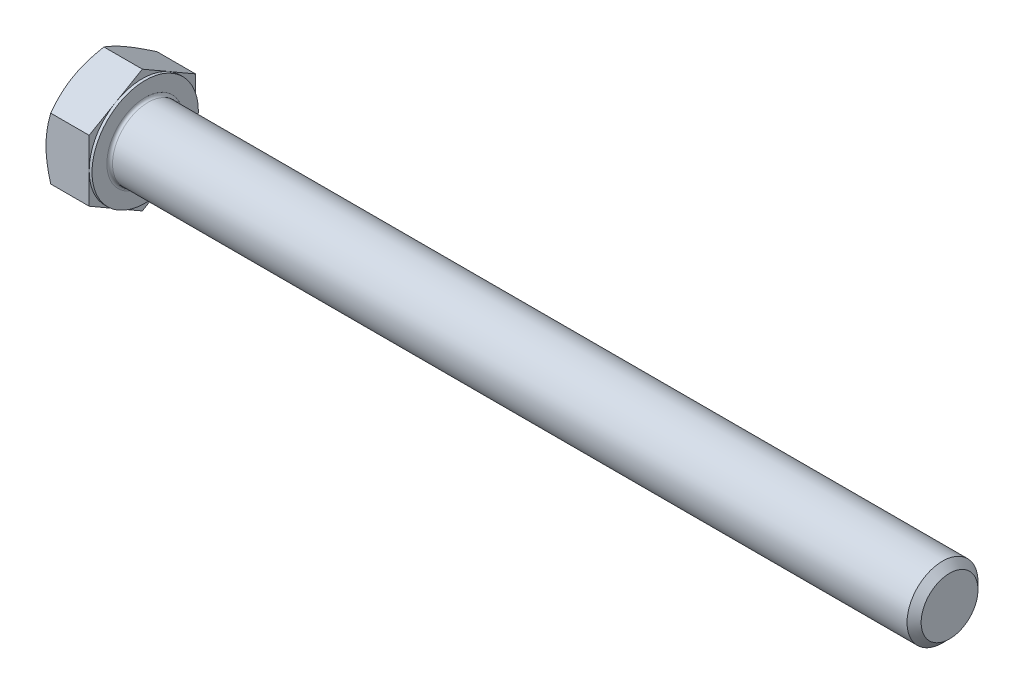
ISO-10303-21;
HEADER;
FILE_DESCRIPTION(('STEP AP214'),'2;1');
FILE_NAME('part.step','',(''),(''),'','','');
FILE_SCHEMA(('AUTOMOTIVE_DESIGN { 1 0 10303 214 1 1 1 1 }'));
ENDSEC;
DATA;
#1=APPLICATION_CONTEXT('core data for automotive mechanical design processes');
#2=APPLICATION_PROTOCOL_DEFINITION('international standard','automotive_design',2000,#1);
#3=PRODUCT_CONTEXT('',#1,'mechanical');
#4=PRODUCT('Part','Part','',(#3));
#5=PRODUCT_RELATED_PRODUCT_CATEGORY('part','',(#4));
#6=PRODUCT_DEFINITION_FORMATION('','',#4);
#7=PRODUCT_DEFINITION_CONTEXT('part definition',#1,'design');
#8=PRODUCT_DEFINITION('design','',#6,#7);
#9=PRODUCT_DEFINITION_SHAPE('','',#8);
#10=(LENGTH_UNIT() NAMED_UNIT(*) SI_UNIT(.MILLI.,.METRE.));
#11=(NAMED_UNIT(*) PLANE_ANGLE_UNIT() SI_UNIT($,.RADIAN.));
#12=(NAMED_UNIT(*) SI_UNIT($,.STERADIAN.) SOLID_ANGLE_UNIT());
#13=UNCERTAINTY_MEASURE_WITH_UNIT(LENGTH_MEASURE(1.E-05),#10,'distance_accuracy_value','');
#14=(GEOMETRIC_REPRESENTATION_CONTEXT(3) GLOBAL_UNCERTAINTY_ASSIGNED_CONTEXT((#13)) GLOBAL_UNIT_ASSIGNED_CONTEXT((#10,
#11,#12)) REPRESENTATION_CONTEXT('',''));
#15=CARTESIAN_POINT('',(0.,0.,0.));
#16=DIRECTION('',(0.,0.,1.));
#17=DIRECTION('',(1.,0.,0.));
#18=AXIS2_PLACEMENT_3D('',#15,#16,#17);
#19=CARTESIAN_POINT('',(6.1722,8.24155962262808,0.));
#20=DIRECTION('',(1.,0.,0.));
#21=DIRECTION('',(0.,0.,-1.));
#22=AXIS2_PLACEMENT_3D('',#19,#20,#21);
#23=PLANE('',#22);
#24=CARTESIAN_POINT('',(6.1722,0.,0.));
#25=DIRECTION('',(1.,0.,0.));
#26=DIRECTION('',(0.,0.,-1.));
#27=AXIS2_PLACEMENT_3D('',#24,#25,#26);
#28=CIRCLE('',#27,5.1435);
#29=CARTESIAN_POINT('',(6.1722,0.,-5.1435));
#30=VERTEX_POINT('',#29);
#31=EDGE_CURVE('E46',#30,#30,#28,.F.);
#32=ORIENTED_EDGE('',*,*,#31,.T.);
#33=EDGE_LOOP('',(#32));
#34=FACE_BOUND('',#33,.T.);
#35=CARTESIAN_POINT('',(6.1722,0.,0.));
#36=DIRECTION('',(1.,0.,0.));
#37=DIRECTION('',(0.,0.,-1.));
#38=AXIS2_PLACEMENT_3D('',#35,#36,#37);
#39=CIRCLE('',#38,7.1374);
#40=CARTESIAN_POINT('',(6.1722,0.,-7.1374));
#41=VERTEX_POINT('',#40);
#42=EDGE_CURVE('E297',#41,#41,#39,.T.);
#43=ORIENTED_EDGE('',*,*,#42,.T.);
#44=EDGE_LOOP('',(#43));
#45=FACE_BOUND('',#44,.T.);
#46=ADVANCED_FACE('F38',(#34,#45),#23,.T.);
#47=CARTESIAN_POINT('',(0.,0.,0.));
#48=DIRECTION('',(-1.,0.,0.));
#49=DIRECTION('',(0.,0.,1.));
#50=AXIS2_PLACEMENT_3D('',#47,#48,#49);
#51=CYLINDRICAL_SURFACE('',#50,4.7625);
#52=CARTESIAN_POINT('',(6.5532,0.,0.));
#53=DIRECTION('',(1.,0.,0.));
#54=DIRECTION('',(0.,0.,-1.));
#55=AXIS2_PLACEMENT_3D('',#52,#53,#54);
#56=CIRCLE('',#55,4.7625);
#57=CARTESIAN_POINT('',(6.5532,0.,-4.7625));
#58=VERTEX_POINT('',#57);
#59=EDGE_CURVE('E11',#58,#58,#56,.T.);
#60=ORIENTED_EDGE('',*,*,#59,.T.);
#61=EDGE_LOOP('',(#60));
#62=FACE_BOUND('',#61,.T.);
#63=CARTESIAN_POINT('',(113.17605,0.,0.));
#64=DIRECTION('',(-1.,0.,0.));
#65=DIRECTION('',(0.,0.,1.));
#66=AXIS2_PLACEMENT_3D('',#63,#64,#65);
#67=CIRCLE('',#66,4.7625);
#68=CARTESIAN_POINT('',(113.17605,0.,4.7625));
#69=VERTEX_POINT('',#68);
#70=EDGE_CURVE('E276',#69,#69,#67,.T.);
#71=ORIENTED_EDGE('',*,*,#70,.T.);
#72=EDGE_LOOP('',(#71));
#73=FACE_BOUND('',#72,.T.);
#74=ADVANCED_FACE('F250',(#62,#73),#51,.T.);
#75=CARTESIAN_POINT('',(114.1222,0.,0.));
#76=DIRECTION('',(-1.,0.,0.));
#77=DIRECTION('',(0.,0.,1.));
#78=AXIS2_PLACEMENT_3D('',#75,#76,#77);
#79=CONICAL_SURFACE('',#78,3.81635,0.785398163397437);
#80=ORIENTED_EDGE('',*,*,#70,.F.);
#81=EDGE_LOOP('',(#80));
#82=FACE_BOUND('',#81,.T.);
#83=CARTESIAN_POINT('',(114.1222,0.,0.));
#84=DIRECTION('',(-1.,0.,0.));
#85=DIRECTION('',(0.,0.,1.));
#86=AXIS2_PLACEMENT_3D('',#83,#84,#85);
#87=CIRCLE('',#86,3.81635);
#88=CARTESIAN_POINT('',(114.1222,0.,3.81635));
#89=VERTEX_POINT('',#88);
#90=EDGE_CURVE('E274',#89,#89,#87,.T.);
#91=ORIENTED_EDGE('',*,*,#90,.T.);
#92=EDGE_LOOP('',(#91));
#93=FACE_BOUND('',#92,.T.);
#94=ADVANCED_FACE('F255',(#82,#93),#79,.T.);
#95=CARTESIAN_POINT('',(114.1222,0.,0.));
#96=DIRECTION('',(-1.,0.,0.));
#97=DIRECTION('',(0.,0.,1.));
#98=AXIS2_PLACEMENT_3D('',#95,#96,#97);
#99=PLANE('',#98);
#100=ORIENTED_EDGE('',*,*,#90,.F.);
#101=EDGE_LOOP('',(#100));
#102=FACE_BOUND('',#101,.T.);
#103=ADVANCED_FACE('F262',(#102),#99,.F.);
#104=CARTESIAN_POINT('',(5.7912,7.1374,0.));
#105=DIRECTION('',(1.,0.,0.));
#106=DIRECTION('',(0.,0.,-1.));
#107=AXIS2_PLACEMENT_3D('',#104,#105,#106);
#108=PLANE('',#107);
#109=DIRECTION('',(0.,0.500000000000001,0.866025403784438));
#110=VECTOR('',#109,1.);
#111=CARTESIAN_POINT('',(5.7912,4.12077981131404,-7.1374));
#112=LINE('',#111,#110);
#113=CARTESIAN_POINT('',(5.7912,4.12077981131404,-7.1374));
#114=VERTEX_POINT('',#113);
#115=CARTESIAN_POINT('',(5.7912,6.18116971697105,-3.56870000000001));
#116=VERTEX_POINT('',#115);
#117=EDGE_CURVE('E170',#114,#116,#112,.T.);
#118=ORIENTED_EDGE('',*,*,#117,.T.);
#119=CARTESIAN_POINT('',(5.7912,0.,0.));
#120=DIRECTION('',(-1.,0.,0.));
#121=DIRECTION('',(0.,0.,1.));
#122=AXIS2_PLACEMENT_3D('',#119,#120,#121);
#123=CIRCLE('',#122,7.1374);
#124=CARTESIAN_POINT('',(5.7912,0.,-7.1374));
#125=VERTEX_POINT('',#124);
#126=EDGE_CURVE('E53',#116,#125,#123,.T.);
#127=ORIENTED_EDGE('',*,*,#126,.T.);
#128=DIRECTION('',(0.,1.,0.));
#129=VECTOR('',#128,1.);
#130=CARTESIAN_POINT('',(5.7912,4.12077981131404,-7.1374));
#131=LINE('',#130,#129);
#132=EDGE_CURVE('E300',#125,#114,#131,.T.);
#133=ORIENTED_EDGE('',*,*,#132,.T.);
#134=EDGE_LOOP('',(#118,#127,#133));
#135=FACE_BOUND('',#134,.T.);
#136=ADVANCED_FACE('F265',(#135),#108,.T.);
#137=CARTESIAN_POINT('',(5.7912,8.24155962262808,0.));
#138=VERTEX_POINT('',#137);
#139=EDGE_CURVE('E168',#116,#138,#112,.T.);
#140=ORIENTED_EDGE('',*,*,#139,.T.);
#141=DIRECTION('',(0.,-0.500000000000001,0.866025403784438));
#142=VECTOR('',#141,1.);
#143=CARTESIAN_POINT('',(5.7912,8.24155962262808,0.));
#144=LINE('',#143,#142);
#145=CARTESIAN_POINT('',(5.7912,6.18116971697105,3.56870000000001));
#146=VERTEX_POINT('',#145);
#147=EDGE_CURVE('E167',#138,#146,#144,.T.);
#148=ORIENTED_EDGE('',*,*,#147,.T.);
#149=EDGE_CURVE('E156',#146,#116,#123,.T.);
#150=ORIENTED_EDGE('',*,*,#149,.T.);
#151=EDGE_LOOP('',(#140,#148,#150));
#152=FACE_BOUND('',#151,.T.);
#153=ADVANCED_FACE('F270',(#152),#108,.T.);
#154=CARTESIAN_POINT('',(5.7912,4.12077981131403,7.1374));
#155=VERTEX_POINT('',#154);
#156=EDGE_CURVE('E135',#146,#155,#144,.T.);
#157=ORIENTED_EDGE('',*,*,#156,.T.);
#158=DIRECTION('',(0.,-1.,0.));
#159=VECTOR('',#158,1.);
#160=CARTESIAN_POINT('',(5.7912,4.12077981131403,7.1374));
#161=LINE('',#160,#159);
#162=CARTESIAN_POINT('',(5.7912,0.,7.1374));
#163=VERTEX_POINT('',#162);
#164=EDGE_CURVE('E129',#155,#163,#161,.T.);
#165=ORIENTED_EDGE('',*,*,#164,.T.);
#166=EDGE_CURVE('E133',#163,#146,#123,.T.);
#167=ORIENTED_EDGE('',*,*,#166,.T.);
#168=EDGE_LOOP('',(#157,#165,#167));
#169=FACE_BOUND('',#168,.T.);
#170=ADVANCED_FACE('F131',(#169),#108,.T.);
#171=CARTESIAN_POINT('',(5.7912,-4.12077981131405,7.1374));
#172=VERTEX_POINT('',#171);
#173=EDGE_CURVE('E139',#163,#172,#161,.T.);
#174=ORIENTED_EDGE('',*,*,#173,.T.);
#175=DIRECTION('',(0.,-0.500000000000001,-0.866025403784438));
#176=VECTOR('',#175,1.);
#177=CARTESIAN_POINT('',(5.7912,-8.2415596226281,0.));
#178=LINE('',#177,#176);
#179=CARTESIAN_POINT('',(5.7912,-6.18116971697105,3.5687));
#180=VERTEX_POINT('',#179);
#181=EDGE_CURVE('E146',#172,#180,#178,.T.);
#182=ORIENTED_EDGE('',*,*,#181,.T.);
#183=EDGE_CURVE('E143',#180,#163,#123,.T.);
#184=ORIENTED_EDGE('',*,*,#183,.T.);
#185=EDGE_LOOP('',(#174,#182,#184));
#186=FACE_BOUND('',#185,.T.);
#187=ADVANCED_FACE('F144',(#186),#108,.T.);
#188=CARTESIAN_POINT('',(5.7912,-8.2415596226281,0.));
#189=VERTEX_POINT('',#188);
#190=EDGE_CURVE('E162',#180,#189,#178,.T.);
#191=ORIENTED_EDGE('',*,*,#190,.T.);
#192=DIRECTION('',(0.,0.500000000000001,-0.866025403784438));
#193=VECTOR('',#192,1.);
#194=CARTESIAN_POINT('',(5.7912,-4.12077981131404,-7.1374));
#195=LINE('',#194,#193);
#196=CARTESIAN_POINT('',(5.7912,-6.18116971697105,-3.56870000000001));
#197=VERTEX_POINT('',#196);
#198=EDGE_CURVE('E338',#189,#197,#195,.T.);
#199=ORIENTED_EDGE('',*,*,#198,.T.);
#200=EDGE_CURVE('E150',#197,#180,#123,.T.);
#201=ORIENTED_EDGE('',*,*,#200,.T.);
#202=EDGE_LOOP('',(#191,#199,#201));
#203=FACE_BOUND('',#202,.T.);
#204=ADVANCED_FACE('F339',(#203),#108,.T.);
#205=CARTESIAN_POINT('',(5.7912,-4.12077981131404,-7.1374));
#206=VERTEX_POINT('',#205);
#207=EDGE_CURVE('E157',#197,#206,#195,.T.);
#208=ORIENTED_EDGE('',*,*,#207,.T.);
#209=EDGE_CURVE('E301',#206,#125,#131,.T.);
#210=ORIENTED_EDGE('',*,*,#209,.T.);
#211=EDGE_CURVE('E308',#125,#197,#123,.T.);
#212=ORIENTED_EDGE('',*,*,#211,.T.);
#213=EDGE_LOOP('',(#208,#210,#212));
#214=FACE_BOUND('',#213,.T.);
#215=ADVANCED_FACE('F271',(#214),#108,.T.);
#216=CARTESIAN_POINT('',(0.,0.,0.));
#217=DIRECTION('',(-1.,0.,0.));
#218=DIRECTION('',(0.,0.,1.));
#219=AXIS2_PLACEMENT_3D('',#216,#217,#218);
#220=CYLINDRICAL_SURFACE('',#219,7.1374);
#221=ORIENTED_EDGE('',*,*,#126,.F.);
#222=ORIENTED_EDGE('',*,*,#149,.F.);
#223=ORIENTED_EDGE('',*,*,#166,.F.);
#224=ORIENTED_EDGE('',*,*,#183,.F.);
#225=ORIENTED_EDGE('',*,*,#200,.F.);
#226=ORIENTED_EDGE('',*,*,#211,.F.);
#227=EDGE_LOOP('',(#221,#222,#223,#224,#225,#226));
#228=FACE_BOUND('',#227,.T.);
#229=ORIENTED_EDGE('',*,*,#42,.F.);
#230=EDGE_LOOP('',(#229));
#231=FACE_BOUND('',#230,.T.);
#232=ADVANCED_FACE('F153',(#228,#231),#220,.T.);
#233=CARTESIAN_POINT('',(0.,8.24155962262808,0.));
#234=DIRECTION('',(1.,0.,0.));
#235=DIRECTION('',(0.,0.,-1.));
#236=AXIS2_PLACEMENT_3D('',#233,#234,#235);
#237=PLANE('',#236);
#238=CARTESIAN_POINT('',(0.,0.,0.));
#239=DIRECTION('',(1.,0.,0.));
#240=DIRECTION('',(0.,0.,-1.));
#241=AXIS2_PLACEMENT_3D('',#238,#239,#240);
#242=CIRCLE('',#241,7.1374);
#243=CARTESIAN_POINT('',(0.,0.,-7.1374));
#244=VERTEX_POINT('',#243);
#245=CARTESIAN_POINT('',(0.,6.18116971697105,-3.56870000000001));
#246=VERTEX_POINT('',#245);
#247=EDGE_CURVE('E296',#244,#246,#242,.T.);
#248=ORIENTED_EDGE('',*,*,#247,.F.);
#249=CARTESIAN_POINT('',(0.,-6.18116971697105,-3.56870000000001));
#250=VERTEX_POINT('',#249);
#251=EDGE_CURVE('E292',#250,#244,#242,.T.);
#252=ORIENTED_EDGE('',*,*,#251,.F.);
#253=CARTESIAN_POINT('',(0.,-6.18116971697105,3.5687));
#254=VERTEX_POINT('',#253);
#255=EDGE_CURVE('E295',#254,#250,#242,.T.);
#256=ORIENTED_EDGE('',*,*,#255,.F.);
#257=CARTESIAN_POINT('',(0.,0.,7.1374));
#258=VERTEX_POINT('',#257);
#259=EDGE_CURVE('E331',#258,#254,#242,.T.);
#260=ORIENTED_EDGE('',*,*,#259,.F.);
#261=CARTESIAN_POINT('',(0.,0.,0.));
#262=DIRECTION('',(-1.,0.,0.));
#263=DIRECTION('',(0.,0.,1.));
#264=AXIS2_PLACEMENT_3D('',#261,#262,#263);
#265=CIRCLE('',#264,7.1374);
#266=CARTESIAN_POINT('',(0.,6.18116971697105,3.56870000000001));
#267=VERTEX_POINT('',#266);
#268=EDGE_CURVE('E171',#258,#267,#265,.T.);
#269=ORIENTED_EDGE('',*,*,#268,.T.);
#270=EDGE_CURVE('E354',#246,#267,#242,.T.);
#271=ORIENTED_EDGE('',*,*,#270,.F.);
#272=EDGE_LOOP('',(#248,#252,#256,#260,#269,#271));
#273=FACE_BOUND('',#272,.T.);
#274=ADVANCED_FACE('F200',(#273),#237,.F.);
#275=CARTESIAN_POINT('',(0.,0.,0.));
#276=DIRECTION('',(1.,0.,0.));
#277=DIRECTION('',(0.,0.,-1.));
#278=AXIS2_PLACEMENT_3D('',#275,#276,#277);
#279=CONICAL_SURFACE('',#278,7.1374,1.0471975511966);
#280=CARTESIAN_POINT('',(0.637553523420339,4.12066434126019,7.1376));
#281=CARTESIAN_POINT('',(0.58526538956535,4.21124371496189,6.98071192263089));
#282=CARTESIAN_POINT('',(0.535350289912878,4.30216081235838,6.82323889066349));
#283=CARTESIAN_POINT('',(0.440919739394803,4.48473335117252,6.50701397737055));
#284=CARTESIAN_POINT('',(0.396406617864097,4.57638909305606,6.34826157562284));
#285=CARTESIAN_POINT('',(0.271843946604595,4.85282383651272,5.86946255497863));
#286=CARTESIAN_POINT('',(0.200994122533559,5.03869401839218,5.54752595635136));
#287=CARTESIAN_POINT('',(0.117914357261565,5.31684536279813,5.06575369564665));
#288=CARTESIAN_POINT('',(0.0942473375753666,5.40829544262839,4.90735751102442));
#289=CARTESIAN_POINT('',(0.0545611977075643,5.59160881473483,4.58984943682929));
#290=CARTESIAN_POINT('',(0.038541401796634,5.68347206977738,4.43073761174693));
#291=CARTESIAN_POINT('',(0.014557978666983,5.86735812462442,4.11223762194846));
#292=CARTESIAN_POINT('',(0.00658520869042971,5.95938062410295,3.95284997741216));
#293=CARTESIAN_POINT('',(-0.00114175893561372,6.14350554574354,3.63393625819102));
#294=CARTESIAN_POINT('',(-0.00089621048245938,6.23560796534863,3.47441018793498));
#295=CARTESIAN_POINT('',(0.0110730517201795,6.48793781485856,3.03736206831758));
#296=CARTESIAN_POINT('',(0.0311658852990948,6.64808264372754,2.75998308814708));
#297=CARTESIAN_POINT('',(0.0948800883359096,6.96730863431005,2.20706745336167));
#298=CARTESIAN_POINT('',(0.138523234308963,7.12638867338148,1.93153274321992));
#299=CARTESIAN_POINT('',(0.247618299095078,7.44625708984547,1.3775043941677));
#300=CARTESIAN_POINT('',(0.313532435992714,7.60700510648809,1.09908066212675));
#301=CARTESIAN_POINT('',(0.463130880450467,7.926103951898,0.546385249240217));
#302=CARTESIAN_POINT('',(0.546780048637376,8.08445886717215,0.272106490357123));
#303=CARTESIAN_POINT('',(0.637553523420346,8.24167509268192,-0.000200000000000164));
#304=B_SPLINE_CURVE_WITH_KNOTS('',3,(#280,#281,#282,#283,#284,#285,#286,#287,#288,#289,#290,
#291,#292,#293,#294,#295,#296,#297,#298,#299,#300,#301,#302,#303),.UNSPECIFIED.,.F.,.F.,(4,2,2,
2,2,2,2,2,2,2,2,4),(0.,0.565616271543686,1.13147557690344,2.26554547664276,2.81869146049268,
3.37178855781927,3.92425653519419,4.4767074445971,5.4384561482934,6.40109569003607,
7.3850851165131,8.36714283329691),.UNSPECIFIED.);
#305=CARTESIAN_POINT('',(0.637486855352628,8.24155962262808,0.));
#306=VERTEX_POINT('',#305);
#307=EDGE_CURVE('E219',#267,#306,#304,.T.);
#308=ORIENTED_EDGE('',*,*,#307,.T.);
#309=CARTESIAN_POINT('',(0.637553523420345,8.24167509268192,0.000200000000000209));
#310=CARTESIAN_POINT('',(0.585265389565357,8.15109571898022,-0.15668807736911));
#311=CARTESIAN_POINT('',(0.535350289912885,8.06017862158373,-0.314161109336511));
#312=CARTESIAN_POINT('',(0.44091973939481,7.87760608276959,-0.63038602262945));
#313=CARTESIAN_POINT('',(0.396406617864103,7.78595034088605,-0.789138424377165));
#314=CARTESIAN_POINT('',(0.2718439466046,7.50951559742939,-1.26793744502137));
#315=CARTESIAN_POINT('',(0.200994122533562,7.32364541554993,-1.58987404364865));
#316=CARTESIAN_POINT('',(0.117914357261569,7.04549407114397,-2.07164630435335));
#317=CARTESIAN_POINT('',(0.0942473375753701,6.95404399131372,-2.23004248897558));
#318=CARTESIAN_POINT('',(0.0545611977075678,6.77073061920728,-2.54755056317072));
#319=CARTESIAN_POINT('',(0.0385414017966372,6.67886736416473,-2.70666238825308));
#320=CARTESIAN_POINT('',(0.0145579786669858,6.49498130931769,-3.02516237805154));
#321=CARTESIAN_POINT('',(0.00658520869043239,6.40295880983916,-3.18455002258784));
#322=CARTESIAN_POINT('',(-0.00114175893561164,6.21883388819857,-3.50346374180898));
#323=CARTESIAN_POINT('',(-0.000896210482457776,6.12673146859347,-3.66298981206503));
#324=CARTESIAN_POINT('',(0.0110730517201801,5.87440161908355,-4.10003793168242));
#325=CARTESIAN_POINT('',(0.031165885299095,5.71425679021457,-4.37741691185292));
#326=CARTESIAN_POINT('',(0.0948800883359092,5.39503079963206,-4.93033254663833));
#327=CARTESIAN_POINT('',(0.138523234308962,5.23595076056063,-5.20586725678008));
#328=CARTESIAN_POINT('',(0.247618299095076,4.91608234409665,-5.75989560583231));
#329=CARTESIAN_POINT('',(0.313532435992711,4.75533432745403,-6.03831933787326));
#330=CARTESIAN_POINT('',(0.463130880450462,4.43623548204412,-6.59101475075978));
#331=CARTESIAN_POINT('',(0.54678004863737,4.27788056676997,-6.86529350964288));
#332=CARTESIAN_POINT('',(0.63755352342034,4.1206643412602,-7.1376));
#333=B_SPLINE_CURVE_WITH_KNOTS('',3,(#309,#310,#311,#312,#313,#314,#315,#316,#317,#318,#319,
#320,#321,#322,#323,#324,#325,#326,#327,#328,#329,#330,#331,#332),.UNSPECIFIED.,.F.,.F.,(4,2,2,
2,2,2,2,2,2,2,2,4),(0.,0.565616271543686,1.13147557690344,2.26554547664276,2.81869146049269,
3.37178855781927,3.9242565351942,4.4767074445971,5.43845614829341,6.40109569003607,
7.3850851165131,8.36714283329691),.UNSPECIFIED.);
#334=EDGE_CURVE('E61',#306,#246,#333,.T.);
#335=ORIENTED_EDGE('',*,*,#334,.T.);
#336=ORIENTED_EDGE('',*,*,#270,.T.);
#337=EDGE_LOOP('',(#308,#335,#336));
#338=FACE_BOUND('',#337,.T.);
#339=ADVANCED_FACE('F355',(#338),#279,.T.);
#340=CARTESIAN_POINT('',(3.51793891464085,-11.1403587268438,7.1374));
#341=CARTESIAN_POINT('',(3.3661176136154,-10.8279722926894,7.1374));
#342=CARTESIAN_POINT('',(3.21573167435815,-10.5148763007017,7.1374));
#343=CARTESIAN_POINT('',(2.91863653133451,-9.88688803265222,7.1374));
#344=CARTESIAN_POINT('',(2.77192789362363,-9.57199548909057,7.1374));
#345=CARTESIAN_POINT('',(2.4822707439764,-8.93844907707205,7.1374));
#346=CARTESIAN_POINT('',(2.33934643030354,-8.61978410734443,7.1374));
#347=CARTESIAN_POINT('',(2.05925336317274,-7.97994405772781,7.1374));
#348=CARTESIAN_POINT('',(1.92208434228597,-7.65876909529411,7.1374));
#349=CARTESIAN_POINT('',(1.65065378230837,-7.00284865103087,7.1374));
#350=CARTESIAN_POINT('',(1.51663374065787,-6.66800268560586,7.1374));
#351=CARTESIAN_POINT('',(1.25856485288051,-5.99442084818067,7.1374));
#352=CARTESIAN_POINT('',(1.13451711533335,-5.65568454847852,7.1374));
#353=CARTESIAN_POINT('',(0.899596727677593,-4.97438980758157,7.1374));
#354=CARTESIAN_POINT('',(0.788698036742921,-4.6318404419915,7.1374));
#355=CARTESIAN_POINT('',(0.583585288609217,-3.94184101121263,7.1374));
#356=CARTESIAN_POINT('',(0.489366053461918,-3.59439250319722,7.1374));
#357=CARTESIAN_POINT('',(0.322585119775292,-2.8962364341233,7.1374));
#358=CARTESIAN_POINT('',(0.249906108267925,-2.5455576685563,7.1374));
#359=CARTESIAN_POINT('',(0.160162927876229,-2.01629019056177,7.1374));
#360=CARTESIAN_POINT('',(0.133459926561138,-1.8393139589974,7.1374));
#361=CARTESIAN_POINT('',(0.0870009608751889,-1.48445773938037,7.1374));
#362=CARTESIAN_POINT('',(0.0672443235865599,-1.30657784056352,7.1374));
#363=CARTESIAN_POINT('',(0.0353233928817926,-0.952509042934691,7.1374));
#364=CARTESIAN_POINT('',(0.0230620606560385,-0.776328928434261,7.1374));
#365=CARTESIAN_POINT('',(0.00600431660240971,-0.42360784078969,7.1374));
#366=CARTESIAN_POINT('',(0.00120777872271334,-0.247066873789374,7.1374));
#367=CARTESIAN_POINT('',(-0.000805707966080239,0.106061109313523,7.1374));
#368=CARTESIAN_POINT('',(0.00197740745485942,0.282648125793647,7.1374));
#369=CARTESIAN_POINT('',(0.0150543642253246,0.635545980126688,7.1374));
#370=CARTESIAN_POINT('',(0.0253485677088149,0.81185680425272,7.1374));
#371=CARTESIAN_POINT('',(0.058717354667661,1.23335791869124,7.1374));
#372=CARTESIAN_POINT('',(0.0852317102922975,1.47828183508493,7.1374));
#373=CARTESIAN_POINT('',(0.151325348901077,1.96634766484073,7.1374));
#374=CARTESIAN_POINT('',(0.190906342916655,2.20948934055999,7.1374));
#375=CARTESIAN_POINT('',(0.327153349211705,2.93593608611635,7.1374));
#376=CARTESIAN_POINT('',(0.44130049501773,3.41600789467397,7.1374));
#377=CARTESIAN_POINT('',(0.639740105584511,4.13409780337112,7.1374));
#378=CARTESIAN_POINT('',(0.711386839279739,4.37582477933244,7.1374));
#379=CARTESIAN_POINT('',(0.862240726867137,4.8569312345941,7.1374));
#380=CARTESIAN_POINT('',(0.941447936163005,5.09631069667751,7.1374));
#381=CARTESIAN_POINT('',(1.10614180608764,5.57279746249286,7.1374));
#382=CARTESIAN_POINT('',(1.19162653724197,5.80990543927402,7.1374));
#383=CARTESIAN_POINT('',(1.36785754588297,6.2821465109029,7.1374));
#384=CARTESIAN_POINT('',(1.4586037216663,6.51727964382368,7.1374));
#385=CARTESIAN_POINT('',(1.70099135878086,7.12822933634875,7.1374));
#386=CARTESIAN_POINT('',(1.85611245200932,7.50266378649051,7.1374));
#387=CARTESIAN_POINT('',(2.17492034788947,8.24788094227115,7.1374));
#388=CARTESIAN_POINT('',(2.338607954525,8.61866330126001,7.1374));
#389=CARTESIAN_POINT('',(2.67260301704526,9.35737269718078,7.1374));
#390=CARTESIAN_POINT('',(2.84291264405929,9.72529874938112,7.1374));
#391=CARTESIAN_POINT('',(3.18863367809307,10.4587232704182,7.1374));
#392=CARTESIAN_POINT('',(3.36404491157501,10.8242218213112,7.1374));
#393=CARTESIAN_POINT('',(3.71915496627049,11.553777334436,7.1374));
#394=CARTESIAN_POINT('',(3.89885959822866,11.9178314626509,7.1374));
#395=CARTESIAN_POINT('',(4.26150568432076,12.6443245246618,7.1374));
#396=CARTESIAN_POINT('',(4.44444716083242,13.0067634472695,7.1374));
#397=CARTESIAN_POINT('',(4.81291716764715,13.7302353242129,7.1374));
#398=CARTESIAN_POINT('',(4.99844519827983,14.0912685333269,7.1374));
#399=CARTESIAN_POINT('',(5.37165471040536,14.8122208146436,7.1374));
#400=CARTESIAN_POINT('',(5.5593362003751,15.1721398824537,7.1374));
#401=CARTESIAN_POINT('',(6.08751400276288,16.178957952041,7.1374));
#402=CARTESIAN_POINT('',(6.43000254365912,16.8248116492746,7.1374));
#403=CARTESIAN_POINT('',(7.11919785487995,18.1143032770824,7.1374));
#404=CARTESIAN_POINT('',(7.46590484738284,18.7579410886394,7.1374));
#405=CARTESIAN_POINT('',(8.16140637459828,20.0415314633599,7.1374));
#406=CARTESIAN_POINT('',(8.51019123426671,20.6814892741017,7.1374));
#407=CARTESIAN_POINT('',(9.21019417047442,21.9600146152105,7.1374));
#408=CARTESIAN_POINT('',(9.56141207357467,22.5985822404971,7.1374));
#409=CARTESIAN_POINT('',(9.91351913441366,23.2366555668877,7.1374));
#410=B_SPLINE_CURVE_WITH_KNOTS('',3,(#340,#341,#342,#343,#344,#345,#346,#347,#348,#349,#350,
#351,#352,#353,#354,#355,#356,#357,#358,#359,#360,#361,#362,#363,#364,#365,#366,#367,#368,#369,
#370,#371,#372,#373,#374,#375,#376,#377,#378,#379,#380,#381,#382,#383,#384,#385,#386,#387,#388,
#389,#390,#391,#392,#393,#394,#395,#396,#397,#398,#399,#400,#401,#402,#403,#404,#405,#406,#407,
#408,#409),.UNSPECIFIED.,.F.,.F.,(4,2,2,2,2,2,2,2,2,2,2,2,2,2,2,2,2,2,2,2,2,2,2,2,2,2,2,2,2,2,2,
2,2,2,4),(0.,1.0419888362068,2.08413709519682,3.13183784368231,4.17948985504911,
5.26137797247103,6.34338619307611,7.42321444996099,8.50270689628368,9.57620733057732,
10.113030795566,10.6498022423129,11.179468394122,11.7091256017988,12.2387872978086,
12.7684745322176,13.507123574382,14.245869378494,15.7241255438818,16.4804246089875,
17.2367292167316,17.9928023300467,18.7488608333938,19.9645892594812,21.1804319893616,
22.3966767697583,23.6128802262777,24.8308351286453,26.0487984545625,27.2665296678531,
28.4842656762732,30.6773737382256,32.8705978115956,35.0570894097065,37.2434267159856),.UNSPECIFIED.);
#411=CARTESIAN_POINT('',(0.637486855352622,4.12077981131403,7.1374));
#412=VERTEX_POINT('',#411);
#413=EDGE_CURVE('E231',#258,#412,#410,.T.);
#414=ORIENTED_EDGE('',*,*,#413,.T.);
#415=EDGE_CURVE('E230',#412,#267,#304,.T.);
#416=ORIENTED_EDGE('',*,*,#415,.T.);
#417=ORIENTED_EDGE('',*,*,#268,.F.);
#418=EDGE_LOOP('',(#414,#416,#417));
#419=FACE_BOUND('',#418,.T.);
#420=ADVANCED_FACE('F325',(#419),#279,.T.);
#421=CARTESIAN_POINT('',(0.637486855352629,-4.12077981131405,7.1374));
#422=VERTEX_POINT('',#421);
#423=EDGE_CURVE('E277',#422,#258,#410,.T.);
#424=ORIENTED_EDGE('',*,*,#423,.T.);
#425=ORIENTED_EDGE('',*,*,#259,.T.);
#426=CARTESIAN_POINT('',(0.637553523420355,-8.24167509268193,-0.000200000000000293));
#427=CARTESIAN_POINT('',(0.585265389565366,-8.15109571898024,0.15668807736911));
#428=CARTESIAN_POINT('',(0.535350289912893,-8.06017862158375,0.314161109336512));
#429=CARTESIAN_POINT('',(0.440919739394818,-7.8776060827696,0.630386022629452));
#430=CARTESIAN_POINT('',(0.396406617864111,-7.78595034088606,0.789138424377167));
#431=CARTESIAN_POINT('',(0.271843946604609,-7.5095155974294,1.26793744502137));
#432=CARTESIAN_POINT('',(0.200994122533572,-7.32364541554995,1.58987404364865));
#433=CARTESIAN_POINT('',(0.117914357261578,-7.04549407114399,2.07164630435336));
#434=CARTESIAN_POINT('',(0.0942473375753785,-6.95404399131374,2.23004248897559));
#435=CARTESIAN_POINT('',(0.0545611977075756,-6.77073061920729,2.54755056317072));
#436=CARTESIAN_POINT('',(0.0385414017966451,-6.67886736416474,2.70666238825308));
#437=CARTESIAN_POINT('',(0.0145579786669937,-6.4949813093177,3.02516237805155));
#438=CARTESIAN_POINT('',(0.00658520869044016,-6.40295880983917,3.18455002258785));
#439=CARTESIAN_POINT('',(-0.00114175893560389,-6.21883388819858,3.50346374180899));
#440=CARTESIAN_POINT('',(-0.000896210482449921,-6.12673146859349,3.66298981206504));
#441=CARTESIAN_POINT('',(0.0110730517201883,-5.87440161908356,4.10003793168243));
#442=CARTESIAN_POINT('',(0.0311658852991035,-5.71425679021458,4.37741691185293));
#443=CARTESIAN_POINT('',(0.0948800883359176,-5.39503079963207,4.93033254663834));
#444=CARTESIAN_POINT('',(0.13852323430897,-5.23595076056065,5.20586725678009));
#445=CARTESIAN_POINT('',(0.247618299095084,-4.91608234409666,5.75989560583231));
#446=CARTESIAN_POINT('',(0.313532435992718,-4.75533432745404,6.03831933787326));
#447=CARTESIAN_POINT('',(0.463130880450469,-4.43623548204413,6.59101475075979));
#448=CARTESIAN_POINT('',(0.546780048637376,-4.27788056676998,6.86529350964288));
#449=CARTESIAN_POINT('',(0.637553523420346,-4.12066434126022,7.1376));
#450=B_SPLINE_CURVE_WITH_KNOTS('',3,(#426,#427,#428,#429,#430,#431,#432,#433,#434,#435,#436,
#437,#438,#439,#440,#441,#442,#443,#444,#445,#446,#447,#448,#449),.UNSPECIFIED.,.F.,.F.,(4,2,2,
2,2,2,2,2,2,2,2,4),(0.,0.565616271543688,1.13147557690344,2.26554547664277,2.81869146049269,
3.37178855781928,3.9242565351942,4.47670744459711,5.43845614829341,6.40109569003608,
7.3850851165131,8.36714283329691),.UNSPECIFIED.);
#451=EDGE_CURVE('E221',#254,#422,#450,.T.);
#452=ORIENTED_EDGE('',*,*,#451,.T.);
#453=EDGE_LOOP('',(#424,#425,#452));
#454=FACE_BOUND('',#453,.T.);
#455=ADVANCED_FACE('F189',(#454),#279,.T.);
#456=CARTESIAN_POINT('',(0.637486855352637,-8.2415596226281,0.));
#457=VERTEX_POINT('',#456);
#458=EDGE_CURVE('E214',#457,#254,#450,.T.);
#459=ORIENTED_EDGE('',*,*,#458,.T.);
#460=ORIENTED_EDGE('',*,*,#255,.T.);
#461=CARTESIAN_POINT('',(0.637553523420343,-4.12066434126021,-7.1376));
#462=CARTESIAN_POINT('',(0.585265389565354,-4.2112437149619,-6.98071192263089));
#463=CARTESIAN_POINT('',(0.535350289912882,-4.30216081235839,-6.82323889066349));
#464=CARTESIAN_POINT('',(0.440919739394808,-4.48473335117254,-6.50701397737055));
#465=CARTESIAN_POINT('',(0.396406617864102,-4.57638909305608,-6.34826157562284));
#466=CARTESIAN_POINT('',(0.2718439466046,-4.85282383651274,-5.86946255497863));
#467=CARTESIAN_POINT('',(0.200994122533564,-5.03869401839219,-5.54752595635135));
#468=CARTESIAN_POINT('',(0.117914357261571,-5.31684536279815,-5.06575369564665));
#469=CARTESIAN_POINT('',(0.094247337575373,-5.4082954426284,-4.90735751102442));
#470=CARTESIAN_POINT('',(0.0545611977075713,-5.59160881473484,-4.58984943682929));
#471=CARTESIAN_POINT('',(0.0385414017966411,-5.6834720697774,-4.43073761174693));
#472=CARTESIAN_POINT('',(0.01455797866699,-5.86735812462444,-4.11223762194846));
#473=CARTESIAN_POINT('',(0.00658520869043655,-5.95938062410297,-3.95284997741216));
#474=CARTESIAN_POINT('',(-0.00114175893560653,-6.14350554574356,-3.63393625819102));
#475=CARTESIAN_POINT('',(-0.000896210482451733,-6.23560796534865,-3.47441018793497));
#476=CARTESIAN_POINT('',(0.0110730517201878,-6.48793781485857,-3.03736206831758));
#477=CARTESIAN_POINT('',(0.0311658852991028,-6.64808264372756,-2.75998308814708));
#478=CARTESIAN_POINT('',(0.0948800883359181,-6.96730863431007,-2.20706745336167));
#479=CARTESIAN_POINT('',(0.138523234308972,-7.12638867338149,-1.93153274321992));
#480=CARTESIAN_POINT('',(0.247618299095088,-7.44625708984548,-1.37750439416769));
#481=CARTESIAN_POINT('',(0.313532435992723,-7.6070051064881,-1.09908066212675));
#482=CARTESIAN_POINT('',(0.463130880450476,-7.92610395189802,-0.546385249240216));
#483=CARTESIAN_POINT('',(0.546780048637384,-8.08445886717217,-0.272106490357122));
#484=CARTESIAN_POINT('',(0.637553523420355,-8.24167509268193,0.000199999999999872));
#485=B_SPLINE_CURVE_WITH_KNOTS('',3,(#461,#462,#463,#464,#465,#466,#467,#468,#469,#470,#471,
#472,#473,#474,#475,#476,#477,#478,#479,#480,#481,#482,#483,#484),.UNSPECIFIED.,.F.,.F.,(4,2,2,
2,2,2,2,2,2,2,2,4),(0.,0.565616271543686,1.13147557690344,2.26554547664276,2.81869146049268,
3.37178855781927,3.92425653519419,4.4767074445971,5.4384561482934,6.40109569003608,
7.3850851165131,8.36714283329691),.UNSPECIFIED.);
#486=EDGE_CURVE('E220',#250,#457,#485,.T.);
#487=ORIENTED_EDGE('',*,*,#486,.T.);
#488=EDGE_LOOP('',(#459,#460,#487));
#489=FACE_BOUND('',#488,.T.);
#490=ADVANCED_FACE('F353',(#489),#279,.T.);
#491=CARTESIAN_POINT('',(0.637486855352623,4.12077981131404,-7.1374));
#492=VERTEX_POINT('',#491);
#493=EDGE_CURVE('E222',#246,#492,#333,.T.);
#494=ORIENTED_EDGE('',*,*,#493,.T.);
#495=CARTESIAN_POINT('',(3.51793891529157,-11.1403587281823,-7.1374));
#496=CARTESIAN_POINT('',(3.36611761423893,-10.8279722939829,-7.1374));
#497=CARTESIAN_POINT('',(3.21573167495451,-10.5148763019502,-7.1374));
#498=CARTESIAN_POINT('',(2.91863653187664,-9.88688803381042,-7.1374));
#499=CARTESIAN_POINT('',(2.77192789413872,-9.57199549020357,-7.1374));
#500=CARTESIAN_POINT('',(2.48227074443738,-8.93844907809396,-7.1374));
#501=CARTESIAN_POINT('',(2.33934643073746,-8.61978410832044,-7.1374));
#502=CARTESIAN_POINT('',(2.059253363553,-7.9799440586117,-7.1374));
#503=CARTESIAN_POINT('',(1.92208434263961,-7.65876909613178,-7.1374));
#504=CARTESIAN_POINT('',(1.65065378260809,-7.00284865177263,-7.1374));
#505=CARTESIAN_POINT('',(1.51663374093033,-6.66800268629789,-7.1374));
#506=CARTESIAN_POINT('',(1.25856485309991,-5.99442084877243,-7.1374));
#507=CARTESIAN_POINT('',(1.13451711552695,-5.65568454901975,-7.1374));
#508=CARTESIAN_POINT('',(0.89959672782208,-4.97438980802079,-7.1374));
#509=CARTESIAN_POINT('',(0.788698036864086,-4.63184044237925,-7.1374));
#510=CARTESIAN_POINT('',(0.583585288687564,-3.94184101149603,-7.1374));
#511=CARTESIAN_POINT('',(0.489366053520766,-3.59439250342776,-7.1374));
#512=CARTESIAN_POINT('',(0.322585119794828,-2.89623643422076,-7.1374));
#513=CARTESIAN_POINT('',(0.249906108269177,-2.54555766857317,-7.1374));
#514=CARTESIAN_POINT('',(0.160162927859161,-2.01629019045636,-7.1374));
#515=CARTESIAN_POINT('',(0.133459926539483,-1.83931395885101,-7.1374));
#516=CARTESIAN_POINT('',(0.0870009608477335,-1.48445773915167,-7.1374));
#517=CARTESIAN_POINT('',(0.0672443235578903,-1.3065778402935,-7.1374));
#518=CARTESIAN_POINT('',(0.0353233928543438,-0.952509042582881,-7.1374));
#519=CARTESIAN_POINT('',(0.0230620606309586,-0.776328928041985,-7.1374));
#520=CARTESIAN_POINT('',(0.00600431658563618,-0.423607840316564,-7.1374));
#521=CARTESIAN_POINT('',(0.00120777871187734,-0.247066873275866,-7.1374));
#522=CARTESIAN_POINT('',(-0.000805707961560346,0.106061109907489,-7.1374));
#523=CARTESIAN_POINT('',(0.00197740746879839,0.28264812642769,-7.1374));
#524=CARTESIAN_POINT('',(0.0150543642613316,0.635545980840357,-7.1374));
#525=CARTESIAN_POINT('',(0.0253485677574711,0.811856805005941,-7.1374));
#526=CARTESIAN_POINT('',(0.0587173547474296,1.2333579195058,-7.1374));
#527=CARTESIAN_POINT('',(0.0852317103899929,1.4782818359211,-7.1374));
#528=CARTESIAN_POINT('',(0.151325349035589,1.96634766571914,-7.1374));
#529=CARTESIAN_POINT('',(0.190906343070057,2.20948934145905,-7.1374));
#530=CARTESIAN_POINT('',(0.327153349422179,2.93593608707621,-7.1374));
#531=CARTESIAN_POINT('',(0.441300495266764,3.4160078956728,-7.1374));
#532=CARTESIAN_POINT('',(0.639740105890462,4.13409780442825,-7.1374));
#533=CARTESIAN_POINT('',(0.711386839604794,4.37582478040941,-7.1374));
#534=CARTESIAN_POINT('',(0.862240727229828,4.85693123571053,-7.1374));
#535=CARTESIAN_POINT('',(0.941447936544229,5.09631069781357,-7.1374));
#536=CARTESIAN_POINT('',(1.10614180650527,5.57279746366803,-7.1374));
#537=CARTESIAN_POINT('',(1.19162653767748,5.80990544046867,-7.1374));
#538=CARTESIAN_POINT('',(1.36785754635362,6.28214651213652,-7.1374));
#539=CARTESIAN_POINT('',(1.45860372215423,6.51727964507679,-7.1374));
#540=CARTESIAN_POINT('',(1.70099135929759,7.12822933761366,-7.1374));
#541=CARTESIAN_POINT('',(1.85611245253596,7.50266378774826,-7.1374));
#542=CARTESIAN_POINT('',(2.1749203484332,8.24788094351546,-7.1374));
#543=CARTESIAN_POINT('',(2.3386079550759,8.61866330249805,-7.1374));
#544=CARTESIAN_POINT('',(2.6726030176085,9.35737269840695,-7.1374));
#545=CARTESIAN_POINT('',(2.8429126446277,9.72529875060169,-7.1374));
#546=CARTESIAN_POINT('',(3.18863367867035,10.4587232716281,-7.1374));
#547=CARTESIAN_POINT('',(3.364044912156,10.8242218225161,-7.1374));
#548=CARTESIAN_POINT('',(3.71915496685771,11.5537773356311,-7.1374));
#549=CARTESIAN_POINT('',(3.89885959881839,11.9178314638412,-7.1374));
#550=CARTESIAN_POINT('',(4.26150568491469,12.6443245258428,-7.1374));
#551=CARTESIAN_POINT('',(4.44444716142804,13.006763448446,-7.1374));
#552=CARTESIAN_POINT('',(4.81291716824556,13.7302353253808,-7.1374));
#553=CARTESIAN_POINT('',(4.99844519887934,14.0912685344906,-7.1374));
#554=CARTESIAN_POINT('',(5.37165471100658,14.8122208157994,-7.1374));
#555=CARTESIAN_POINT('',(5.55933620097694,15.1721398836055,-7.1374));
#556=CARTESIAN_POINT('',(6.08751400336931,16.1789579531886,-7.1374));
#557=CARTESIAN_POINT('',(6.43000254426915,16.824811650422,-7.1374));
#558=CARTESIAN_POINT('',(7.11919785549645,18.1143032782299,-7.1374));
#559=CARTESIAN_POINT('',(7.46590484800222,18.757941089787,-7.1374));
#560=CARTESIAN_POINT('',(8.16140637522346,20.0415314645091,-7.1374));
#561=CARTESIAN_POINT('',(8.51019123489483,20.6814892752525,-7.1374));
#562=CARTESIAN_POINT('',(9.21019417110809,21.9600146163644,-7.1374));
#563=CARTESIAN_POINT('',(9.56141207421095,22.5985822416527,-7.1374));
#564=CARTESIAN_POINT('',(9.91351913505243,23.2366555680451,-7.1374));
#565=B_SPLINE_CURVE_WITH_KNOTS('',3,(#495,#496,#497,#498,#499,#500,#501,#502,#503,#504,#505,
#506,#507,#508,#509,#510,#511,#512,#513,#514,#515,#516,#517,#518,#519,#520,#521,#522,#523,#524,
#525,#526,#527,#528,#529,#530,#531,#532,#533,#534,#535,#536,#537,#538,#539,#540,#541,#542,#543,
#544,#545,#546,#547,#548,#549,#550,#551,#552,#553,#554,#555,#556,#557,#558,#559,#560,#561,#562,
#563,#564),.UNSPECIFIED.,.F.,.F.,(4,2,2,2,2,2,2,2,2,2,2,2,2,2,2,2,2,2,2,2,2,2,2,2,2,2,2,2,2,2,2,
2,2,2,4),(0.,1.04198883636395,2.08413709551114,3.1318378441555,4.17948985568116,
5.26137797327195,6.34338619404597,7.42321445109922,8.50270689759014,9.57620733213103,
10.1130307972433,10.6498022441137,11.1794683960432,11.7091256038406,12.2387872999709,
12.7684745345005,13.507123576735,14.2458693809173,15.7241255464457,16.4804246116249,
17.2367292194424,17.9928023328306,18.748860836251,19.96458926233,21.1804319922019,
22.3966767725898,23.6128802291006,24.8308351314585,26.048798457366,27.2665296706471,
28.4842656790577,30.6773737410147,32.8705978143893,35.0570894125083,37.2434267187957),.UNSPECIFIED.);
#566=EDGE_CURVE('E182',#492,#244,#565,.F.);
#567=ORIENTED_EDGE('',*,*,#566,.T.);
#568=ORIENTED_EDGE('',*,*,#247,.T.);
#569=EDGE_LOOP('',(#494,#567,#568));
#570=FACE_BOUND('',#569,.T.);
#571=ADVANCED_FACE('F350',(#570),#279,.T.);
#572=CARTESIAN_POINT('',(0.637486855352626,-4.12077981131404,-7.1374));
#573=VERTEX_POINT('',#572);
#574=EDGE_CURVE('E183',#573,#250,#485,.T.);
#575=ORIENTED_EDGE('',*,*,#574,.T.);
#576=ORIENTED_EDGE('',*,*,#251,.T.);
#577=EDGE_CURVE('E174',#244,#573,#565,.F.);
#578=ORIENTED_EDGE('',*,*,#577,.T.);
#579=EDGE_LOOP('',(#575,#576,#578));
#580=FACE_BOUND('',#579,.T.);
#581=ADVANCED_FACE('F198',(#580),#279,.T.);
#582=CARTESIAN_POINT('',(6.1722,4.12077981131404,-7.1374));
#583=DIRECTION('',(0.,0.,1.));
#584=DIRECTION('',(0.,-1.,0.));
#585=AXIS2_PLACEMENT_3D('',#582,#583,#584);
#586=PLANE('',#585);
#587=ORIENTED_EDGE('',*,*,#209,.F.);
#588=DIRECTION('',(-1.,0.,0.));
#589=VECTOR('',#588,1.);
#590=CARTESIAN_POINT('',(6.1722,-4.12077981131404,-7.1374));
#591=LINE('',#590,#589);
#592=EDGE_CURVE('E283',#206,#573,#591,.T.);
#593=ORIENTED_EDGE('',*,*,#592,.T.);
#594=ORIENTED_EDGE('',*,*,#577,.F.);
#595=ORIENTED_EDGE('',*,*,#566,.F.);
#596=DIRECTION('',(-1.,0.,0.));
#597=VECTOR('',#596,1.);
#598=CARTESIAN_POINT('',(6.1722,4.12077981131404,-7.1374));
#599=LINE('',#598,#597);
#600=EDGE_CURVE('E279',#114,#492,#599,.T.);
#601=ORIENTED_EDGE('',*,*,#600,.F.);
#602=ORIENTED_EDGE('',*,*,#132,.F.);
#603=EDGE_LOOP('',(#587,#593,#594,#595,#601,#602));
#604=FACE_BOUND('',#603,.T.);
#605=ADVANCED_FACE('F193',(#604),#586,.F.);
#606=CARTESIAN_POINT('',(6.1722,-4.12077981131404,-7.1374));
#607=DIRECTION('',(0.,0.866025403784438,0.500000000000001));
#608=DIRECTION('',(0.,-0.500000000000001,0.866025403784438));
#609=AXIS2_PLACEMENT_3D('',#606,#607,#608);
#610=PLANE('',#609);
#611=ORIENTED_EDGE('',*,*,#198,.F.);
#612=DIRECTION('',(-1.,0.,0.));
#613=VECTOR('',#612,1.);
#614=CARTESIAN_POINT('',(6.1722,-8.2415596226281,0.));
#615=LINE('',#614,#613);
#616=EDGE_CURVE('E285',#189,#457,#615,.T.);
#617=ORIENTED_EDGE('',*,*,#616,.T.);
#618=ORIENTED_EDGE('',*,*,#486,.F.);
#619=ORIENTED_EDGE('',*,*,#574,.F.);
#620=ORIENTED_EDGE('',*,*,#592,.F.);
#621=ORIENTED_EDGE('',*,*,#207,.F.);
#622=EDGE_LOOP('',(#611,#617,#618,#619,#620,#621));
#623=FACE_BOUND('',#622,.T.);
#624=ADVANCED_FACE('F197',(#623),#610,.F.);
#625=CARTESIAN_POINT('',(6.1722,-8.2415596226281,0.));
#626=DIRECTION('',(0.,0.866025403784438,-0.500000000000001));
#627=DIRECTION('',(0.,0.500000000000001,0.866025403784438));
#628=AXIS2_PLACEMENT_3D('',#625,#626,#627);
#629=PLANE('',#628);
#630=ORIENTED_EDGE('',*,*,#181,.F.);
#631=DIRECTION('',(-1.,0.,0.));
#632=VECTOR('',#631,1.);
#633=CARTESIAN_POINT('',(6.1722,-4.12077981131405,7.1374));
#634=LINE('',#633,#632);
#635=EDGE_CURVE('E161',#172,#422,#634,.T.);
#636=ORIENTED_EDGE('',*,*,#635,.T.);
#637=ORIENTED_EDGE('',*,*,#451,.F.);
#638=ORIENTED_EDGE('',*,*,#458,.F.);
#639=ORIENTED_EDGE('',*,*,#616,.F.);
#640=ORIENTED_EDGE('',*,*,#190,.F.);
#641=EDGE_LOOP('',(#630,#636,#637,#638,#639,#640));
#642=FACE_BOUND('',#641,.T.);
#643=ADVANCED_FACE('F205',(#642),#629,.F.);
#644=CARTESIAN_POINT('',(6.1722,4.12077981131403,7.1374));
#645=DIRECTION('',(0.,0.,-1.));
#646=DIRECTION('',(-1.,0.,0.));
#647=AXIS2_PLACEMENT_3D('',#644,#645,#646);
#648=PLANE('',#647);
#649=ORIENTED_EDGE('',*,*,#164,.F.);
#650=DIRECTION('',(-1.,0.,0.));
#651=VECTOR('',#650,1.);
#652=CARTESIAN_POINT('',(6.1722,4.12077981131403,7.1374));
#653=LINE('',#652,#651);
#654=EDGE_CURVE('E288',#155,#412,#653,.T.);
#655=ORIENTED_EDGE('',*,*,#654,.T.);
#656=ORIENTED_EDGE('',*,*,#413,.F.);
#657=ORIENTED_EDGE('',*,*,#423,.F.);
#658=ORIENTED_EDGE('',*,*,#635,.F.);
#659=ORIENTED_EDGE('',*,*,#173,.F.);
#660=EDGE_LOOP('',(#649,#655,#656,#657,#658,#659));
#661=FACE_BOUND('',#660,.T.);
#662=ADVANCED_FACE('F159',(#661),#648,.F.);
#663=CARTESIAN_POINT('',(6.1722,8.24155962262808,0.));
#664=DIRECTION('',(0.,-0.866025403784438,-0.500000000000001));
#665=DIRECTION('',(0.,0.500000000000001,-0.866025403784438));
#666=AXIS2_PLACEMENT_3D('',#663,#664,#665);
#667=PLANE('',#666);
#668=ORIENTED_EDGE('',*,*,#147,.F.);
#669=DIRECTION('',(-1.,0.,0.));
#670=VECTOR('',#669,1.);
#671=CARTESIAN_POINT('',(6.1722,8.24155962262808,0.));
#672=LINE('',#671,#670);
#673=EDGE_CURVE('E290',#138,#306,#672,.T.);
#674=ORIENTED_EDGE('',*,*,#673,.T.);
#675=ORIENTED_EDGE('',*,*,#307,.F.);
#676=ORIENTED_EDGE('',*,*,#415,.F.);
#677=ORIENTED_EDGE('',*,*,#654,.F.);
#678=ORIENTED_EDGE('',*,*,#156,.F.);
#679=EDGE_LOOP('',(#668,#674,#675,#676,#677,#678));
#680=FACE_BOUND('',#679,.T.);
#681=ADVANCED_FACE('F236',(#680),#667,.F.);
#682=CARTESIAN_POINT('',(6.1722,4.12077981131404,-7.1374));
#683=DIRECTION('',(0.,-0.866025403784438,0.500000000000001));
#684=DIRECTION('',(0.,-0.500000000000001,-0.866025403784438));
#685=AXIS2_PLACEMENT_3D('',#682,#683,#684);
#686=PLANE('',#685);
#687=ORIENTED_EDGE('',*,*,#117,.F.);
#688=ORIENTED_EDGE('',*,*,#600,.T.);
#689=ORIENTED_EDGE('',*,*,#493,.F.);
#690=ORIENTED_EDGE('',*,*,#334,.F.);
#691=ORIENTED_EDGE('',*,*,#673,.F.);
#692=ORIENTED_EDGE('',*,*,#139,.F.);
#693=EDGE_LOOP('',(#687,#688,#689,#690,#691,#692));
#694=FACE_BOUND('',#693,.T.);
#695=ADVANCED_FACE('F239',(#694),#686,.F.);
#696=CARTESIAN_POINT('',(6.5532,0.,0.));
#697=DIRECTION('',(1.,0.,0.));
#698=DIRECTION('',(0.,0.,-1.));
#699=AXIS2_PLACEMENT_3D('',#696,#697,#698);
#700=TOROIDAL_SURFACE('',#699,5.1435,0.381);
#701=ORIENTED_EDGE('',*,*,#59,.F.);
#702=EDGE_LOOP('',(#701));
#703=FACE_BOUND('',#702,.T.);
#704=ORIENTED_EDGE('',*,*,#31,.F.);
#705=EDGE_LOOP('',(#704));
#706=FACE_BOUND('',#705,.T.);
#707=ADVANCED_FACE('F40',(#703,#706),#700,.F.);
#708=CLOSED_SHELL('',(#46,#74,#94,#103,#136,#153,#170,#187,#204,#215,#232,#274,#339,#420,#455,
#490,#571,#581,#605,#624,#643,#662,#681,#695,#707));
#709=MANIFOLD_SOLID_BREP('B2',#708);
#710=ADVANCED_BREP_SHAPE_REPRESENTATION('',(#18,#709),#14);
#711=SHAPE_DEFINITION_REPRESENTATION(#9,#710);
ENDSEC;
END-ISO-10303-21;
